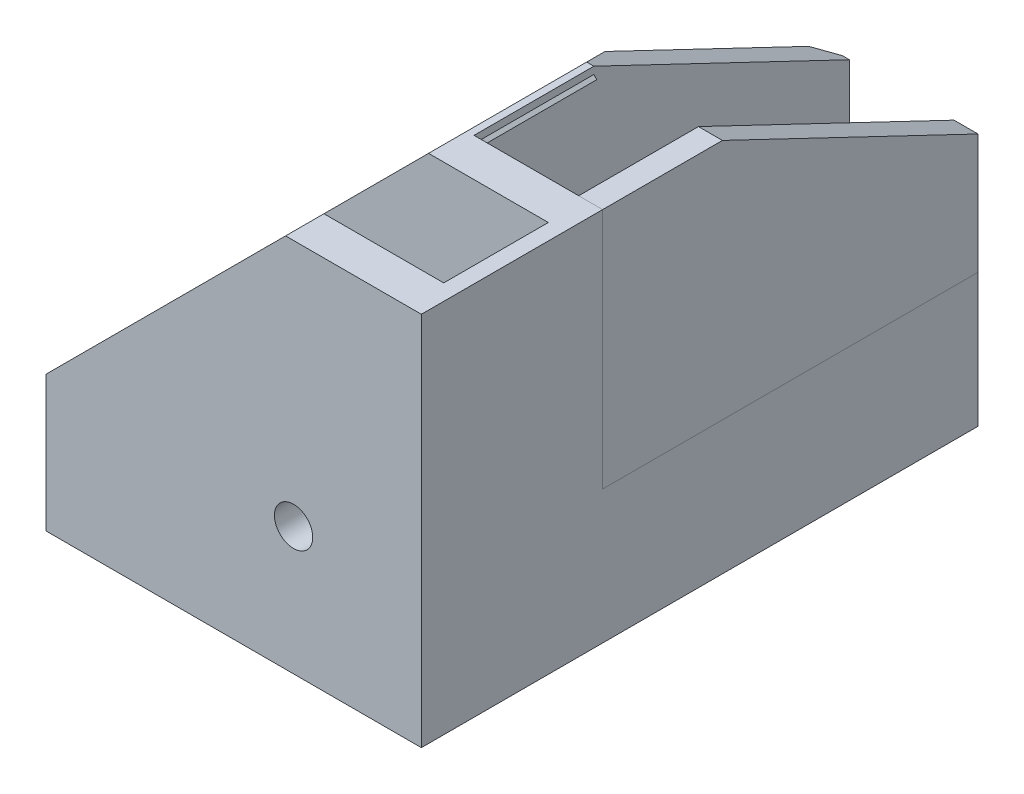
ISO-10303-21;
HEADER;
FILE_DESCRIPTION(('STEP AP214'),'2;1');
FILE_NAME('part.step','',(''),(''),'','','');
FILE_SCHEMA(('AUTOMOTIVE_DESIGN { 1 0 10303 214 1 1 1 1 }'));
ENDSEC;
DATA;
#1=APPLICATION_CONTEXT('core data for automotive mechanical design processes');
#2=APPLICATION_PROTOCOL_DEFINITION('international standard','automotive_design',2000,#1);
#3=PRODUCT_CONTEXT('',#1,'mechanical');
#4=PRODUCT('Part','Part','',(#3));
#5=PRODUCT_RELATED_PRODUCT_CATEGORY('part','',(#4));
#6=PRODUCT_DEFINITION_FORMATION('','',#4);
#7=PRODUCT_DEFINITION_CONTEXT('part definition',#1,'design');
#8=PRODUCT_DEFINITION('design','',#6,#7);
#9=PRODUCT_DEFINITION_SHAPE('','',#8);
#10=(LENGTH_UNIT() NAMED_UNIT(*) SI_UNIT(.MILLI.,.METRE.));
#11=(NAMED_UNIT(*) PLANE_ANGLE_UNIT() SI_UNIT($,.RADIAN.));
#12=(NAMED_UNIT(*) SI_UNIT($,.STERADIAN.) SOLID_ANGLE_UNIT());
#13=UNCERTAINTY_MEASURE_WITH_UNIT(LENGTH_MEASURE(1.E-05),#10,'distance_accuracy_value','');
#14=(GEOMETRIC_REPRESENTATION_CONTEXT(3) GLOBAL_UNCERTAINTY_ASSIGNED_CONTEXT((#13)) GLOBAL_UNIT_ASSIGNED_CONTEXT((#10,
#11,#12)) REPRESENTATION_CONTEXT('',''));
#15=CARTESIAN_POINT('',(0.,0.,0.));
#16=DIRECTION('',(0.,0.,1.));
#17=DIRECTION('',(1.,0.,0.));
#18=AXIS2_PLACEMENT_3D('',#15,#16,#17);
#19=CARTESIAN_POINT('',(-30.7272077938642,30.7272077938642,0.));
#20=DIRECTION('',(-0.707106781186548,0.707106781186547,0.));
#21=DIRECTION('',(-0.707106781186547,-0.707106781186548,0.));
#22=AXIS2_PLACEMENT_3D('',#19,#20,#21);
#23=PLANE('',#22);
#24=DIRECTION('',(0.,0.,-1.));
#25=VECTOR('',#24,1.);
#26=CARTESIAN_POINT('',(-15.7272077938642,45.7272077938642,-6.55));
#27=LINE('',#26,#25);
#28=CARTESIAN_POINT('',(-15.7272077938642,45.7272077938642,-11.35));
#29=VERTEX_POINT('',#28);
#30=CARTESIAN_POINT('',(-15.7272077938642,45.7272077938642,-26.35));
#31=VERTEX_POINT('',#30);
#32=EDGE_CURVE('E378',#29,#31,#27,.T.);
#33=ORIENTED_EDGE('',*,*,#32,.F.);
#34=DIRECTION('',(-0.707106781186547,-0.707106781186548,0.));
#35=VECTOR('',#34,1.);
#36=CARTESIAN_POINT('',(-30.7272077938642,30.7272077938642,-11.35));
#37=LINE('',#36,#35);
#38=CARTESIAN_POINT('',(-16.1,45.3544155877285,-11.35));
#39=VERTEX_POINT('',#38);
#40=EDGE_CURVE('E12',#29,#39,#37,.T.);
#41=ORIENTED_EDGE('',*,*,#40,.T.);
#42=DIRECTION('',(0.,0.,-1.));
#43=VECTOR('',#42,1.);
#44=CARTESIAN_POINT('',(-16.1,45.3544155877285,-58.35));
#45=LINE('',#44,#43);
#46=CARTESIAN_POINT('',(-16.1,45.3544155877285,-26.35));
#47=VERTEX_POINT('',#46);
#48=EDGE_CURVE('E405',#39,#47,#45,.T.);
#49=ORIENTED_EDGE('',*,*,#48,.T.);
#50=DIRECTION('',(-0.707106781186547,-0.707106781186548,0.));
#51=VECTOR('',#50,1.);
#52=CARTESIAN_POINT('',(-15.7272077938642,45.7272077938642,-26.35));
#53=LINE('',#52,#51);
#54=EDGE_CURVE('E382',#31,#47,#53,.T.);
#55=ORIENTED_EDGE('',*,*,#54,.F.);
#56=EDGE_LOOP('',(#33,#41,#49,#55));
#57=FACE_BOUND('',#56,.T.);
#58=ADVANCED_FACE('F43',(#57),#23,.F.);
#59=CARTESIAN_POINT('',(-15.7272077938642,45.7272077938642,-26.35));
#60=DIRECTION('',(0.,0.,-1.));
#61=DIRECTION('',(-1.,0.,0.));
#62=AXIS2_PLACEMENT_3D('',#59,#60,#61);
#63=PLANE('',#62);
#64=CARTESIAN_POINT('',(-19.1,42.3544155877285,-26.35));
#65=VERTEX_POINT('',#64);
#66=CARTESIAN_POINT('',(-44.7544155877284,16.7,-26.35));
#67=VERTEX_POINT('',#66);
#68=EDGE_CURVE('E380',#65,#67,#53,.T.);
#69=ORIENTED_EDGE('',*,*,#68,.T.);
#70=DIRECTION('',(-1.,0.,0.));
#71=VECTOR('',#70,1.);
#72=CARTESIAN_POINT('',(-15.7272077938642,16.7,-26.35));
#73=LINE('',#72,#71);
#74=CARTESIAN_POINT('',(-47.,16.7,-26.35));
#75=VERTEX_POINT('',#74);
#76=EDGE_CURVE('E370',#67,#75,#73,.T.);
#77=ORIENTED_EDGE('',*,*,#76,.T.);
#78=DIRECTION('',(-0.707106781186548,0.707106781186547,0.));
#79=VECTOR('',#78,1.);
#80=CARTESIAN_POINT('',(-45.8772077938642,15.5772077938642,-26.35));
#81=LINE('',#80,#79);
#82=CARTESIAN_POINT('',(-47.15,16.85,-26.35));
#83=VERTEX_POINT('',#82);
#84=EDGE_CURVE('E393',#75,#83,#81,.T.);
#85=ORIENTED_EDGE('',*,*,#84,.T.);
#86=DIRECTION('',(-0.707106781186547,-0.707106781186548,0.));
#87=VECTOR('',#86,1.);
#88=CARTESIAN_POINT('',(-17.,47.,-26.35));
#89=LINE('',#88,#87);
#90=CARTESIAN_POINT('',(-19.1,44.9,-26.35));
#91=VERTEX_POINT('',#90);
#92=EDGE_CURVE('E381',#91,#83,#89,.T.);
#93=ORIENTED_EDGE('',*,*,#92,.F.);
#94=DIRECTION('',(0.,1.,0.));
#95=VECTOR('',#94,1.);
#96=CARTESIAN_POINT('',(-19.1,16.7,-26.35));
#97=LINE('',#96,#95);
#98=EDGE_CURVE('E402',#65,#91,#97,.T.);
#99=ORIENTED_EDGE('',*,*,#98,.F.);
#100=EDGE_LOOP('',(#69,#77,#85,#93,#99));
#101=FACE_BOUND('',#100,.T.);
#102=ADVANCED_FACE('F480',(#101),#63,.T.);
#103=CARTESIAN_POINT('',(-45.8772077938642,15.5772077938642,-11.35));
#104=DIRECTION('',(-0.707106781186547,-0.707106781186548,0.));
#105=DIRECTION('',(0.707106781186548,-0.707106781186547,0.));
#106=AXIS2_PLACEMENT_3D('',#103,#104,#105);
#107=PLANE('',#106);
#108=DIRECTION('',(0.,0.,1.));
#109=VECTOR('',#108,1.);
#110=CARTESIAN_POINT('',(-47.,16.7,-11.35));
#111=LINE('',#110,#109);
#112=CARTESIAN_POINT('',(-47.,16.7,-6.55));
#113=VERTEX_POINT('',#112);
#114=EDGE_CURVE('E451',#75,#113,#111,.T.);
#115=ORIENTED_EDGE('',*,*,#114,.T.);
#116=DIRECTION('',(-0.707106781186548,0.707106781186547,0.));
#117=VECTOR('',#116,1.);
#118=CARTESIAN_POINT('',(-45.8772077938642,15.5772077938642,-6.55));
#119=LINE('',#118,#117);
#120=CARTESIAN_POINT('',(-47.15,16.85,-6.55));
#121=VERTEX_POINT('',#120);
#122=EDGE_CURVE('E385',#113,#121,#119,.T.);
#123=ORIENTED_EDGE('',*,*,#122,.T.);
#124=DIRECTION('',(0.,0.,1.));
#125=VECTOR('',#124,1.);
#126=CARTESIAN_POINT('',(-47.15,16.85,-11.35));
#127=LINE('',#126,#125);
#128=EDGE_CURVE('E377',#83,#121,#127,.T.);
#129=ORIENTED_EDGE('',*,*,#128,.F.);
#130=ORIENTED_EDGE('',*,*,#84,.F.);
#131=EDGE_LOOP('',(#115,#123,#129,#130));
#132=FACE_BOUND('',#131,.T.);
#133=ADVANCED_FACE('F482',(#132),#107,.T.);
#134=CARTESIAN_POINT('',(-19.1,16.7,-58.35));
#135=DIRECTION('',(1.,0.,0.));
#136=DIRECTION('',(0.,1.,0.));
#137=AXIS2_PLACEMENT_3D('',#134,#135,#136);
#138=PLANE('',#137);
#139=DIRECTION('',(0.,0.,1.));
#140=VECTOR('',#139,1.);
#141=CARTESIAN_POINT('',(-19.1,42.3544155877285,-58.35));
#142=LINE('',#141,#140);
#143=CARTESIAN_POINT('',(-19.1,42.3544155877285,-11.35));
#144=VERTEX_POINT('',#143);
#145=EDGE_CURVE('E407',#65,#144,#142,.T.);
#146=ORIENTED_EDGE('',*,*,#145,.F.);
#147=ORIENTED_EDGE('',*,*,#98,.T.);
#148=DIRECTION('',(0.,0.,1.));
#149=VECTOR('',#148,1.);
#150=CARTESIAN_POINT('',(-19.1,44.9,-58.35));
#151=LINE('',#150,#149);
#152=CARTESIAN_POINT('',(-19.1,44.9,-30.7421568627451));
#153=VERTEX_POINT('',#152);
#154=EDGE_CURVE('E445',#153,#91,#151,.T.);
#155=ORIENTED_EDGE('',*,*,#154,.F.);
#156=DIRECTION('',(0.,-0.431355734164351,-0.902181927664002));
#157=VECTOR('',#156,1.);
#158=CARTESIAN_POINT('',(-19.1,28.908983459053,-64.1874202163597));
#159=LINE('',#158,#157);
#160=CARTESIAN_POINT('',(-19.1,32.7040625,-56.25));
#161=VERTEX_POINT('',#160);
#162=EDGE_CURVE('E64',#153,#161,#159,.T.);
#163=ORIENTED_EDGE('',*,*,#162,.T.);
#164=DIRECTION('',(0.,-1.,0.));
#165=VECTOR('',#164,1.);
#166=CARTESIAN_POINT('',(-19.1,63.7,-56.25));
#167=LINE('',#166,#165);
#168=CARTESIAN_POINT('',(-19.1,16.7,-56.25));
#169=VERTEX_POINT('',#168);
#170=EDGE_CURVE('E422',#161,#169,#167,.T.);
#171=ORIENTED_EDGE('',*,*,#170,.T.);
#172=DIRECTION('',(0.,0.,1.));
#173=VECTOR('',#172,1.);
#174=CARTESIAN_POINT('',(-19.1,16.7,-58.35));
#175=LINE('',#174,#173);
#176=CARTESIAN_POINT('',(-19.1,16.7,-11.35));
#177=VERTEX_POINT('',#176);
#178=EDGE_CURVE('E429',#169,#177,#175,.T.);
#179=ORIENTED_EDGE('',*,*,#178,.T.);
#180=DIRECTION('',(0.,1.,0.));
#181=VECTOR('',#180,1.);
#182=CARTESIAN_POINT('',(-19.1,16.7,-11.35));
#183=LINE('',#182,#181);
#184=EDGE_CURVE('E425',#177,#144,#183,.T.);
#185=ORIENTED_EDGE('',*,*,#184,.T.);
#186=EDGE_LOOP('',(#146,#147,#155,#163,#171,#179,#185));
#187=FACE_BOUND('',#186,.T.);
#188=ADVANCED_FACE('F45',(#187),#138,.F.);
#189=CARTESIAN_POINT('',(-19.1,44.9,-58.35));
#190=DIRECTION('',(0.707106781186546,-0.707106781186549,0.));
#191=DIRECTION('',(0.707106781186549,0.707106781186546,0.));
#192=AXIS2_PLACEMENT_3D('',#189,#190,#191);
#193=PLANE('',#192);
#194=DIRECTION('',(0.707106781186547,0.707106781186548,0.));
#195=VECTOR('',#194,1.);
#196=CARTESIAN_POINT('',(-47.15,16.85,-6.55));
#197=LINE('',#196,#195);
#198=CARTESIAN_POINT('',(-17.,47.,-6.55));
#199=VERTEX_POINT('',#198);
#200=EDGE_CURVE('E388',#121,#199,#197,.T.);
#201=ORIENTED_EDGE('',*,*,#200,.T.);
#202=DIRECTION('',(0.,0.,1.));
#203=VECTOR('',#202,1.);
#204=CARTESIAN_POINT('',(-17.,47.,-58.35));
#205=LINE('',#204,#203);
#206=CARTESIAN_POINT('',(-17.,47.,-26.35));
#207=VERTEX_POINT('',#206);
#208=EDGE_CURVE('E443',#207,#199,#205,.T.);
#209=ORIENTED_EDGE('',*,*,#208,.F.);
#210=DIRECTION('',(-0.396078094015386,-0.396078094015385,-0.828398628006034));
#211=VECTOR('',#210,1.);
#212=CARTESIAN_POINT('',(-28.1584245868461,35.8415754131539,-49.6878814888284));
#213=LINE('',#212,#211);
#214=EDGE_CURVE('E417',#207,#153,#213,.T.);
#215=ORIENTED_EDGE('',*,*,#214,.T.);
#216=ORIENTED_EDGE('',*,*,#154,.T.);
#217=ORIENTED_EDGE('',*,*,#92,.T.);
#218=ORIENTED_EDGE('',*,*,#128,.T.);
#219=EDGE_LOOP('',(#201,#209,#215,#216,#217,#218));
#220=FACE_BOUND('',#219,.T.);
#221=ADVANCED_FACE('F486',(#220),#193,.F.);
#222=CARTESIAN_POINT('',(-17.,47.,-58.35));
#223=DIRECTION('',(0.,-1.,0.));
#224=DIRECTION('',(0.,0.,-1.));
#225=AXIS2_PLACEMENT_3D('',#222,#223,#224);
#226=PLANE('',#225);
#227=DIRECTION('',(0.,0.,1.));
#228=VECTOR('',#227,1.);
#229=CARTESIAN_POINT('',(-16.1,47.,-58.35));
#230=LINE('',#229,#228);
#231=CARTESIAN_POINT('',(-16.1,47.,-26.35));
#232=VERTEX_POINT('',#231);
#233=CARTESIAN_POINT('',(-16.1,47.,-11.35));
#234=VERTEX_POINT('',#233);
#235=EDGE_CURVE('E440',#232,#234,#230,.T.);
#236=ORIENTED_EDGE('',*,*,#235,.F.);
#237=DIRECTION('',(1.,0.,0.));
#238=VECTOR('',#237,1.);
#239=CARTESIAN_POINT('',(-47.,47.,-26.35));
#240=LINE('',#239,#238);
#241=EDGE_CURVE('E413',#207,#232,#240,.T.);
#242=ORIENTED_EDGE('',*,*,#241,.F.);
#243=ORIENTED_EDGE('',*,*,#208,.T.);
#244=DIRECTION('',(-1.,0.,0.));
#245=VECTOR('',#244,1.);
#246=CARTESIAN_POINT('',(-17.,47.,-6.55));
#247=LINE('',#246,#245);
#248=CARTESIAN_POINT('',(-2.,47.,-6.55));
#249=VERTEX_POINT('',#248);
#250=EDGE_CURVE('E329',#249,#199,#247,.T.);
#251=ORIENTED_EDGE('',*,*,#250,.F.);
#252=DIRECTION('',(0.,0.,1.));
#253=VECTOR('',#252,1.);
#254=CARTESIAN_POINT('',(-2.,47.,-6.55));
#255=LINE('',#254,#253);
#256=CARTESIAN_POINT('',(-2.,47.,6.55));
#257=VERTEX_POINT('',#256);
#258=EDGE_CURVE('E332',#249,#257,#255,.T.);
#259=ORIENTED_EDGE('',*,*,#258,.T.);
#260=DIRECTION('',(-1.,0.,0.));
#261=VECTOR('',#260,1.);
#262=CARTESIAN_POINT('',(-17.,47.,6.55));
#263=LINE('',#262,#261);
#264=CARTESIAN_POINT('',(-17.,47.,6.55));
#265=VERTEX_POINT('',#264);
#266=EDGE_CURVE('E237',#257,#265,#263,.T.);
#267=ORIENTED_EDGE('',*,*,#266,.T.);
#268=DIRECTION('',(0.,0.,-1.));
#269=VECTOR('',#268,1.);
#270=CARTESIAN_POINT('',(-17.,47.,11.35));
#271=LINE('',#270,#269);
#272=CARTESIAN_POINT('',(-17.,47.,11.35));
#273=VERTEX_POINT('',#272);
#274=EDGE_CURVE('E362',#273,#265,#271,.T.);
#275=ORIENTED_EDGE('',*,*,#274,.F.);
#276=DIRECTION('',(-1.,0.,0.));
#277=VECTOR('',#276,1.);
#278=CARTESIAN_POINT('',(0.,47.,11.35));
#279=LINE('',#278,#277);
#280=CARTESIAN_POINT('',(0.,47.,11.35));
#281=VERTEX_POINT('',#280);
#282=EDGE_CURVE('E345',#281,#273,#279,.T.);
#283=ORIENTED_EDGE('',*,*,#282,.F.);
#284=DIRECTION('',(0.,0.,-1.));
#285=VECTOR('',#284,1.);
#286=CARTESIAN_POINT('',(0.,47.,11.35));
#287=LINE('',#286,#285);
#288=CARTESIAN_POINT('',(0.,47.,-11.35));
#289=VERTEX_POINT('',#288);
#290=EDGE_CURVE('E365',#281,#289,#287,.T.);
#291=ORIENTED_EDGE('',*,*,#290,.T.);
#292=DIRECTION('',(-1.,0.,0.));
#293=VECTOR('',#292,1.);
#294=CARTESIAN_POINT('',(0.,47.,-11.35));
#295=LINE('',#294,#293);
#296=EDGE_CURVE('E353',#289,#234,#295,.T.);
#297=ORIENTED_EDGE('',*,*,#296,.T.);
#298=EDGE_LOOP('',(#236,#242,#243,#251,#259,#267,#275,#283,#291,#297));
#299=FACE_BOUND('',#298,.T.);
#300=ADVANCED_FACE('F492',(#299),#226,.F.);
#301=CARTESIAN_POINT('',(-16.1,47.,-58.35));
#302=DIRECTION('',(-1.,0.,0.));
#303=DIRECTION('',(0.,-1.,0.));
#304=AXIS2_PLACEMENT_3D('',#301,#302,#303);
#305=PLANE('',#304);
#306=DIRECTION('',(0.,-1.,0.));
#307=VECTOR('',#306,1.);
#308=CARTESIAN_POINT('',(-16.1,47.,-11.35));
#309=LINE('',#308,#307);
#310=CARTESIAN_POINT('',(-16.1,46.1,-11.35));
#311=VERTEX_POINT('',#310);
#312=EDGE_CURVE('E430',#234,#311,#309,.T.);
#313=ORIENTED_EDGE('',*,*,#312,.T.);
#314=DIRECTION('',(0.,0.,-1.));
#315=VECTOR('',#314,1.);
#316=CARTESIAN_POINT('',(-16.1,46.1,-58.35));
#317=LINE('',#316,#315);
#318=CARTESIAN_POINT('',(-16.1,46.1,-26.35));
#319=VERTEX_POINT('',#318);
#320=EDGE_CURVE('E410',#311,#319,#317,.T.);
#321=ORIENTED_EDGE('',*,*,#320,.T.);
#322=DIRECTION('',(0.,-1.,0.));
#323=VECTOR('',#322,1.);
#324=CARTESIAN_POINT('',(-16.1,47.,-26.35));
#325=LINE('',#324,#323);
#326=EDGE_CURVE('E395',#319,#47,#325,.T.);
#327=ORIENTED_EDGE('',*,*,#326,.T.);
#328=ORIENTED_EDGE('',*,*,#48,.F.);
#329=CARTESIAN_POINT('',(-16.1,16.7,-11.35));
#330=VERTEX_POINT('',#329);
#331=EDGE_CURVE('E433',#39,#330,#309,.T.);
#332=ORIENTED_EDGE('',*,*,#331,.T.);
#333=DIRECTION('',(0.,0.,1.));
#334=VECTOR('',#333,1.);
#335=CARTESIAN_POINT('',(-16.1,16.7,-58.35));
#336=LINE('',#335,#334);
#337=CARTESIAN_POINT('',(-16.1,16.7,-58.35));
#338=VERTEX_POINT('',#337);
#339=EDGE_CURVE('E438',#338,#330,#336,.T.);
#340=ORIENTED_EDGE('',*,*,#339,.F.);
#341=DIRECTION('',(0.,-1.,0.));
#342=VECTOR('',#341,1.);
#343=CARTESIAN_POINT('',(-16.1,47.,-58.35));
#344=LINE('',#343,#342);
#345=CARTESIAN_POINT('',(-16.1,31.7,-58.35));
#346=VERTEX_POINT('',#345);
#347=EDGE_CURVE('E426',#346,#338,#344,.T.);
#348=ORIENTED_EDGE('',*,*,#347,.F.);
#349=DIRECTION('',(0.,0.431355734164351,0.902181927664002));
#350=VECTOR('',#349,1.);
#351=CARTESIAN_POINT('',(-16.1,34.5468368717659,-52.3958313793131));
#352=LINE('',#351,#350);
#353=EDGE_CURVE('E419',#346,#232,#352,.T.);
#354=ORIENTED_EDGE('',*,*,#353,.T.);
#355=ORIENTED_EDGE('',*,*,#235,.T.);
#356=EDGE_LOOP('',(#313,#321,#327,#328,#332,#340,#348,#354,#355));
#357=FACE_BOUND('',#356,.T.);
#358=ADVANCED_FACE('F496',(#357),#305,.F.);
#359=CARTESIAN_POINT('',(0.,0.,-58.35));
#360=DIRECTION('',(0.,0.,-1.));
#361=DIRECTION('',(-1.,0.,0.));
#362=AXIS2_PLACEMENT_3D('',#359,#360,#361);
#363=PLANE('',#362);
#364=DIRECTION('',(1.,0.,0.));
#365=VECTOR('',#364,1.);
#366=CARTESIAN_POINT('',(-47.,31.7,-58.35));
#367=LINE('',#366,#365);
#368=CARTESIAN_POINT('',(-17.,31.7,-58.35));
#369=VERTEX_POINT('',#368);
#370=EDGE_CURVE('E58',#369,#346,#367,.T.);
#371=ORIENTED_EDGE('',*,*,#370,.T.);
#372=ORIENTED_EDGE('',*,*,#347,.T.);
#373=DIRECTION('',(1.,0.,0.));
#374=VECTOR('',#373,1.);
#375=CARTESIAN_POINT('',(-47.,16.7,-58.35));
#376=LINE('',#375,#374);
#377=CARTESIAN_POINT('',(0.,16.7,-58.35));
#378=VERTEX_POINT('',#377);
#379=EDGE_CURVE('E294',#338,#378,#376,.T.);
#380=ORIENTED_EDGE('',*,*,#379,.T.);
#381=DIRECTION('',(0.,-1.,0.));
#382=VECTOR('',#381,1.);
#383=CARTESIAN_POINT('',(0.,14.7,-58.35));
#384=LINE('',#383,#382);
#385=CARTESIAN_POINT('',(0.,0.,-58.35));
#386=VERTEX_POINT('',#385);
#387=EDGE_CURVE('E296',#378,#386,#384,.T.);
#388=ORIENTED_EDGE('',*,*,#387,.T.);
#389=DIRECTION('',(-1.,0.,0.));
#390=VECTOR('',#389,1.);
#391=CARTESIAN_POINT('',(-47.,0.,-58.35));
#392=LINE('',#391,#390);
#393=CARTESIAN_POINT('',(-17.,0.,-58.35));
#394=VERTEX_POINT('',#393);
#395=EDGE_CURVE('E283',#386,#394,#392,.T.);
#396=ORIENTED_EDGE('',*,*,#395,.T.);
#397=DIRECTION('',(0.,1.,0.));
#398=VECTOR('',#397,1.);
#399=CARTESIAN_POINT('',(-17.,0.,-58.35));
#400=LINE('',#399,#398);
#401=CARTESIAN_POINT('',(-17.,1.8,-58.35));
#402=VERTEX_POINT('',#401);
#403=EDGE_CURVE('E269',#394,#402,#400,.T.);
#404=ORIENTED_EDGE('',*,*,#403,.T.);
#405=DIRECTION('',(1.,0.,0.));
#406=VECTOR('',#405,1.);
#407=CARTESIAN_POINT('',(-2.,1.8,-58.35));
#408=LINE('',#407,#406);
#409=CARTESIAN_POINT('',(-2.,1.8,-58.35));
#410=VERTEX_POINT('',#409);
#411=EDGE_CURVE('E286',#402,#410,#408,.T.);
#412=ORIENTED_EDGE('',*,*,#411,.T.);
#413=DIRECTION('',(0.,1.,0.));
#414=VECTOR('',#413,1.);
#415=CARTESIAN_POINT('',(-2.,1.8,-58.35));
#416=LINE('',#415,#414);
#417=CARTESIAN_POINT('',(-2.,14.9,-58.35));
#418=VERTEX_POINT('',#417);
#419=EDGE_CURVE('E289',#410,#418,#416,.T.);
#420=ORIENTED_EDGE('',*,*,#419,.T.);
#421=DIRECTION('',(-1.,0.,0.));
#422=VECTOR('',#421,1.);
#423=CARTESIAN_POINT('',(-2.,14.9,-58.35));
#424=LINE('',#423,#422);
#425=CARTESIAN_POINT('',(-17.,14.9,-58.35));
#426=VERTEX_POINT('',#425);
#427=EDGE_CURVE('E291',#418,#426,#424,.T.);
#428=ORIENTED_EDGE('',*,*,#427,.T.);
#429=DIRECTION('',(0.,-1.,0.));
#430=VECTOR('',#429,1.);
#431=CARTESIAN_POINT('',(-17.,0.,-58.35));
#432=LINE('',#431,#430);
#433=EDGE_CURVE('E448',#369,#426,#432,.T.);
#434=ORIENTED_EDGE('',*,*,#433,.F.);
#435=EDGE_LOOP('',(#371,#372,#380,#388,#396,#404,#412,#420,#428,#434));
#436=FACE_BOUND('',#435,.T.);
#437=ADVANCED_FACE('F500',(#436),#363,.T.);
#438=CARTESIAN_POINT('',(-19.1,63.7,-56.25));
#439=DIRECTION('',(0.707106781186554,0.,0.707106781186541));
#440=DIRECTION('',(0.707106781186541,0.,-0.707106781186554));
#441=AXIS2_PLACEMENT_3D('',#438,#439,#440);
#442=PLANE('',#441);
#443=ORIENTED_EDGE('',*,*,#170,.F.);
#444=DIRECTION('',(0.669859304744955,-0.320276480081187,-0.669859304744967));
#445=VECTOR('',#444,1.);
#446=CARTESIAN_POINT('',(-25.7498740189914,35.8835335153303,-49.6001259810085));
#447=LINE('',#446,#445);
#448=EDGE_CURVE('E450',#161,#369,#447,.T.);
#449=ORIENTED_EDGE('',*,*,#448,.T.);
#450=ORIENTED_EDGE('',*,*,#433,.T.);
#451=DIRECTION('',(0.707106781186548,0.,-0.707106781186548));
#452=VECTOR('',#451,1.);
#453=CARTESIAN_POINT('',(-9.5,14.9,-65.85));
#454=LINE('',#453,#452);
#455=CARTESIAN_POINT('',(-47.,14.9,-28.35));
#456=VERTEX_POINT('',#455);
#457=EDGE_CURVE('E276',#456,#426,#454,.T.);
#458=ORIENTED_EDGE('',*,*,#457,.F.);
#459=DIRECTION('',(0.,1.,0.));
#460=VECTOR('',#459,1.);
#461=CARTESIAN_POINT('',(-47.,0.,-28.35));
#462=LINE('',#461,#460);
#463=CARTESIAN_POINT('',(-47.,16.7,-28.35));
#464=VERTEX_POINT('',#463);
#465=EDGE_CURVE('E268',#456,#464,#462,.T.);
#466=ORIENTED_EDGE('',*,*,#465,.T.);
#467=DIRECTION('',(-0.707106781186548,0.,0.707106781186548));
#468=VECTOR('',#467,1.);
#469=CARTESIAN_POINT('',(-32.,16.7,-43.35));
#470=LINE('',#469,#468);
#471=EDGE_CURVE('E272',#169,#464,#470,.T.);
#472=ORIENTED_EDGE('',*,*,#471,.F.);
#473=EDGE_LOOP('',(#443,#449,#450,#458,#466,#472));
#474=FACE_BOUND('',#473,.T.);
#475=ADVANCED_FACE('F473',(#474),#442,.F.);
#476=CARTESIAN_POINT('',(-47.,31.7,-58.35));
#477=DIRECTION('',(0.,-0.902181927664002,0.431355734164351));
#478=DIRECTION('',(0.,-0.431355734164351,-0.902181927664002));
#479=AXIS2_PLACEMENT_3D('',#476,#477,#478);
#480=PLANE('',#479);
#481=ORIENTED_EDGE('',*,*,#370,.F.);
#482=ORIENTED_EDGE('',*,*,#448,.F.);
#483=ORIENTED_EDGE('',*,*,#162,.F.);
#484=ORIENTED_EDGE('',*,*,#214,.F.);
#485=ORIENTED_EDGE('',*,*,#241,.T.);
#486=ORIENTED_EDGE('',*,*,#353,.F.);
#487=EDGE_LOOP('',(#481,#482,#483,#484,#485,#486));
#488=FACE_BOUND('',#487,.T.);
#489=ADVANCED_FACE('F489',(#488),#480,.F.);
#490=CARTESIAN_POINT('',(-15.7272077938642,45.7272077938642,-6.55));
#491=DIRECTION('',(0.707106781186547,0.707106781186548,0.));
#492=DIRECTION('',(-0.707106781186548,0.707106781186547,0.));
#493=AXIS2_PLACEMENT_3D('',#490,#491,#492);
#494=PLANE('',#493);
#495=DIRECTION('',(-0.707106781186548,0.707106781186547,0.));
#496=VECTOR('',#495,1.);
#497=CARTESIAN_POINT('',(-15.7272077938642,45.7272077938642,-11.35));
#498=LINE('',#497,#496);
#499=EDGE_CURVE('E375',#29,#311,#498,.T.);
#500=ORIENTED_EDGE('',*,*,#499,.F.);
#501=ORIENTED_EDGE('',*,*,#32,.T.);
#502=DIRECTION('',(-0.707106781186548,0.707106781186547,0.));
#503=VECTOR('',#502,1.);
#504=CARTESIAN_POINT('',(-15.7272077938642,45.7272077938642,-26.35));
#505=LINE('',#504,#503);
#506=EDGE_CURVE('E396',#31,#319,#505,.T.);
#507=ORIENTED_EDGE('',*,*,#506,.T.);
#508=ORIENTED_EDGE('',*,*,#320,.F.);
#509=EDGE_LOOP('',(#500,#501,#507,#508));
#510=FACE_BOUND('',#509,.T.);
#511=ADVANCED_FACE('F566',(#510),#494,.T.);
#512=ORIENTED_EDGE('',*,*,#145,.T.);
#513=CARTESIAN_POINT('',(-44.7544155877285,16.7,-11.35));
#514=VERTEX_POINT('',#513);
#515=EDGE_CURVE('E47',#144,#514,#37,.T.);
#516=ORIENTED_EDGE('',*,*,#515,.T.);
#517=DIRECTION('',(0.,0.,1.));
#518=VECTOR('',#517,1.);
#519=CARTESIAN_POINT('',(-44.7544155877285,16.7,0.));
#520=LINE('',#519,#518);
#521=EDGE_CURVE('E373',#67,#514,#520,.T.);
#522=ORIENTED_EDGE('',*,*,#521,.F.);
#523=ORIENTED_EDGE('',*,*,#68,.F.);
#524=EDGE_LOOP('',(#512,#516,#522,#523));
#525=FACE_BOUND('',#524,.T.);
#526=ADVANCED_FACE('F458',(#525),#23,.F.);
#527=ORIENTED_EDGE('',*,*,#326,.F.);
#528=ORIENTED_EDGE('',*,*,#506,.F.);
#529=ORIENTED_EDGE('',*,*,#54,.T.);
#530=EDGE_LOOP('',(#527,#528,#529));
#531=FACE_BOUND('',#530,.T.);
#532=ADVANCED_FACE('F545',(#531),#63,.T.);
#533=CARTESIAN_POINT('',(-45.8772077938642,15.5772077938642,-6.55));
#534=DIRECTION('',(0.,0.,1.));
#535=DIRECTION('',(1.,0.,0.));
#536=AXIS2_PLACEMENT_3D('',#533,#534,#535);
#537=PLANE('',#536);
#538=ORIENTED_EDGE('',*,*,#250,.T.);
#539=ORIENTED_EDGE('',*,*,#200,.F.);
#540=ORIENTED_EDGE('',*,*,#122,.F.);
#541=DIRECTION('',(0.,-1.,0.));
#542=VECTOR('',#541,1.);
#543=CARTESIAN_POINT('',(-47.,17.,-6.55));
#544=LINE('',#543,#542);
#545=CARTESIAN_POINT('',(-47.,0.,-6.55));
#546=VERTEX_POINT('',#545);
#547=EDGE_CURVE('E326',#113,#546,#544,.T.);
#548=ORIENTED_EDGE('',*,*,#547,.T.);
#549=DIRECTION('',(1.,0.,0.));
#550=VECTOR('',#549,1.);
#551=CARTESIAN_POINT('',(-2.,0.,-6.55));
#552=LINE('',#551,#550);
#553=CARTESIAN_POINT('',(-2.,0.,-6.55));
#554=VERTEX_POINT('',#553);
#555=EDGE_CURVE('E256',#546,#554,#552,.T.);
#556=ORIENTED_EDGE('',*,*,#555,.T.);
#557=DIRECTION('',(0.,1.,0.));
#558=VECTOR('',#557,1.);
#559=CARTESIAN_POINT('',(-2.,47.,-6.55));
#560=LINE('',#559,#558);
#561=EDGE_CURVE('E246',#554,#249,#560,.T.);
#562=ORIENTED_EDGE('',*,*,#561,.T.);
#563=EDGE_LOOP('',(#538,#539,#540,#548,#556,#562));
#564=FACE_BOUND('',#563,.T.);
#565=ADVANCED_FACE('F543',(#564),#537,.T.);
#566=CARTESIAN_POINT('',(0.,0.,-11.35));
#567=DIRECTION('',(0.,0.,-1.));
#568=DIRECTION('',(-1.,0.,0.));
#569=AXIS2_PLACEMENT_3D('',#566,#567,#568);
#570=PLANE('',#569);
#571=ORIENTED_EDGE('',*,*,#184,.F.);
#572=DIRECTION('',(1.,0.,0.));
#573=VECTOR('',#572,1.);
#574=CARTESIAN_POINT('',(-47.,16.7,-11.35));
#575=LINE('',#574,#573);
#576=EDGE_CURVE('E287',#514,#177,#575,.T.);
#577=ORIENTED_EDGE('',*,*,#576,.F.);
#578=ORIENTED_EDGE('',*,*,#515,.F.);
#579=EDGE_LOOP('',(#571,#577,#578));
#580=FACE_BOUND('',#579,.T.);
#581=ADVANCED_FACE('F464',(#580),#570,.T.);
#582=ORIENTED_EDGE('',*,*,#331,.F.);
#583=ORIENTED_EDGE('',*,*,#40,.F.);
#584=ORIENTED_EDGE('',*,*,#499,.T.);
#585=ORIENTED_EDGE('',*,*,#312,.F.);
#586=ORIENTED_EDGE('',*,*,#296,.F.);
#587=DIRECTION('',(0.,1.,0.));
#588=VECTOR('',#587,1.);
#589=CARTESIAN_POINT('',(0.,0.,-11.35));
#590=LINE('',#589,#588);
#591=CARTESIAN_POINT('',(0.,16.7,-11.35));
#592=VERTEX_POINT('',#591);
#593=EDGE_CURVE('E338',#592,#289,#590,.T.);
#594=ORIENTED_EDGE('',*,*,#593,.F.);
#595=EDGE_CURVE('E308',#330,#592,#575,.T.);
#596=ORIENTED_EDGE('',*,*,#595,.F.);
#597=EDGE_LOOP('',(#582,#583,#584,#585,#586,#594,#596));
#598=FACE_BOUND('',#597,.T.);
#599=ADVANCED_FACE('F551',(#598),#570,.T.);
#600=CARTESIAN_POINT('',(-47.,16.7,-58.35));
#601=DIRECTION('',(0.,-1.,0.));
#602=DIRECTION('',(0.,0.,-1.));
#603=AXIS2_PLACEMENT_3D('',#600,#601,#602);
#604=PLANE('',#603);
#605=ORIENTED_EDGE('',*,*,#576,.T.);
#606=ORIENTED_EDGE('',*,*,#178,.F.);
#607=ORIENTED_EDGE('',*,*,#471,.T.);
#608=DIRECTION('',(0.,0.,1.));
#609=VECTOR('',#608,1.);
#610=CARTESIAN_POINT('',(-47.,16.7,-58.35));
#611=LINE('',#610,#609);
#612=EDGE_CURVE('E312',#464,#75,#611,.T.);
#613=ORIENTED_EDGE('',*,*,#612,.T.);
#614=ORIENTED_EDGE('',*,*,#76,.F.);
#615=ORIENTED_EDGE('',*,*,#521,.T.);
#616=EDGE_LOOP('',(#605,#606,#607,#613,#614,#615));
#617=FACE_BOUND('',#616,.T.);
#618=ADVANCED_FACE('F467',(#617),#604,.F.);
#619=ORIENTED_EDGE('',*,*,#379,.F.);
#620=ORIENTED_EDGE('',*,*,#339,.T.);
#621=ORIENTED_EDGE('',*,*,#595,.T.);
#622=DIRECTION('',(0.,0.,1.));
#623=VECTOR('',#622,1.);
#624=CARTESIAN_POINT('',(0.,16.7,-58.35));
#625=LINE('',#624,#623);
#626=EDGE_CURVE('E299',#378,#592,#625,.T.);
#627=ORIENTED_EDGE('',*,*,#626,.F.);
#628=EDGE_LOOP('',(#619,#620,#621,#627));
#629=FACE_BOUND('',#628,.T.);
#630=ADVANCED_FACE('F585',(#629),#604,.F.);
#631=CARTESIAN_POINT('',(-47.,0.,11.35));
#632=DIRECTION('',(1.,0.,0.));
#633=DIRECTION('',(0.,0.,-1.));
#634=AXIS2_PLACEMENT_3D('',#631,#632,#633);
#635=PLANE('',#634);
#636=DIRECTION('',(0.,-1.,0.));
#637=VECTOR('',#636,1.);
#638=CARTESIAN_POINT('',(-47.,17.,6.55));
#639=LINE('',#638,#637);
#640=CARTESIAN_POINT('',(-47.,17.,6.55));
#641=VERTEX_POINT('',#640);
#642=CARTESIAN_POINT('',(-47.,0.,6.55));
#643=VERTEX_POINT('',#642);
#644=EDGE_CURVE('E240',#641,#643,#639,.T.);
#645=ORIENTED_EDGE('',*,*,#644,.T.);
#646=DIRECTION('',(0.,0.,-1.));
#647=VECTOR('',#646,1.);
#648=CARTESIAN_POINT('',(-47.,0.,11.35));
#649=LINE('',#648,#647);
#650=CARTESIAN_POINT('',(-47.,0.,11.35));
#651=VERTEX_POINT('',#650);
#652=EDGE_CURVE('E255',#651,#643,#649,.T.);
#653=ORIENTED_EDGE('',*,*,#652,.F.);
#654=DIRECTION('',(0.,-1.,0.));
#655=VECTOR('',#654,1.);
#656=CARTESIAN_POINT('',(-47.,0.,11.35));
#657=LINE('',#656,#655);
#658=CARTESIAN_POINT('',(-47.,17.,11.35));
#659=VERTEX_POINT('',#658);
#660=EDGE_CURVE('E349',#659,#651,#657,.T.);
#661=ORIENTED_EDGE('',*,*,#660,.F.);
#662=DIRECTION('',(0.,0.,-1.));
#663=VECTOR('',#662,1.);
#664=CARTESIAN_POINT('',(-47.,17.,11.35));
#665=LINE('',#664,#663);
#666=EDGE_CURVE('E359',#659,#641,#665,.T.);
#667=ORIENTED_EDGE('',*,*,#666,.T.);
#668=EDGE_LOOP('',(#645,#653,#661,#667));
#669=FACE_BOUND('',#668,.T.);
#670=ADVANCED_FACE('F537',(#669),#635,.F.);
#671=CARTESIAN_POINT('',(-17.,47.,11.35));
#672=DIRECTION('',(0.707106781186548,-0.707106781186548,0.));
#673=DIRECTION('',(0.707106781186548,0.707106781186548,0.));
#674=AXIS2_PLACEMENT_3D('',#671,#672,#673);
#675=PLANE('',#674);
#676=DIRECTION('',(-0.707106781186547,-0.707106781186547,0.));
#677=VECTOR('',#676,1.);
#678=CARTESIAN_POINT('',(-47.,17.,6.55));
#679=LINE('',#678,#677);
#680=EDGE_CURVE('E325',#265,#641,#679,.T.);
#681=ORIENTED_EDGE('',*,*,#680,.T.);
#682=ORIENTED_EDGE('',*,*,#666,.F.);
#683=DIRECTION('',(-0.707106781186547,-0.707106781186547,0.));
#684=VECTOR('',#683,1.);
#685=CARTESIAN_POINT('',(-17.,47.,11.35));
#686=LINE('',#685,#684);
#687=EDGE_CURVE('E347',#273,#659,#686,.T.);
#688=ORIENTED_EDGE('',*,*,#687,.F.);
#689=ORIENTED_EDGE('',*,*,#274,.T.);
#690=EDGE_LOOP('',(#681,#682,#688,#689));
#691=FACE_BOUND('',#690,.T.);
#692=ADVANCED_FACE('F539',(#691),#675,.F.);
#693=CARTESIAN_POINT('',(0.,0.,11.35));
#694=DIRECTION('',(0.,1.,0.));
#695=DIRECTION('',(-1.,0.,0.));
#696=AXIS2_PLACEMENT_3D('',#693,#694,#695);
#697=PLANE('',#696);
#698=ORIENTED_EDGE('',*,*,#652,.T.);
#699=DIRECTION('',(-1.,0.,0.));
#700=VECTOR('',#699,1.);
#701=CARTESIAN_POINT('',(-47.,0.,6.55));
#702=LINE('',#701,#700);
#703=CARTESIAN_POINT('',(-2.,0.,6.55));
#704=VERTEX_POINT('',#703);
#705=EDGE_CURVE('E234',#704,#643,#702,.T.);
#706=ORIENTED_EDGE('',*,*,#705,.F.);
#707=DIRECTION('',(0.,0.,1.));
#708=VECTOR('',#707,1.);
#709=CARTESIAN_POINT('',(-2.,0.,6.55));
#710=LINE('',#709,#708);
#711=EDGE_CURVE('E243',#554,#704,#710,.T.);
#712=ORIENTED_EDGE('',*,*,#711,.F.);
#713=ORIENTED_EDGE('',*,*,#555,.F.);
#714=CARTESIAN_POINT('',(-47.,0.,-28.35));
#715=VERTEX_POINT('',#714);
#716=EDGE_CURVE('E351',#546,#715,#649,.T.);
#717=ORIENTED_EDGE('',*,*,#716,.T.);
#718=DIRECTION('',(0.707106781186547,0.,-0.707106781186547));
#719=VECTOR('',#718,1.);
#720=CARTESIAN_POINT('',(-17.,0.,-58.35));
#721=LINE('',#720,#719);
#722=EDGE_CURVE('E265',#715,#394,#721,.T.);
#723=ORIENTED_EDGE('',*,*,#722,.T.);
#724=ORIENTED_EDGE('',*,*,#395,.F.);
#725=DIRECTION('',(0.,0.,-1.));
#726=VECTOR('',#725,1.);
#727=CARTESIAN_POINT('',(0.,0.,11.35));
#728=LINE('',#727,#726);
#729=CARTESIAN_POINT('',(0.,0.,11.35));
#730=VERTEX_POINT('',#729);
#731=EDGE_CURVE('E368',#730,#386,#728,.T.);
#732=ORIENTED_EDGE('',*,*,#731,.F.);
#733=DIRECTION('',(1.,0.,0.));
#734=VECTOR('',#733,1.);
#735=CARTESIAN_POINT('',(0.,0.,11.35));
#736=LINE('',#735,#734);
#737=EDGE_CURVE('E339',#651,#730,#736,.T.);
#738=ORIENTED_EDGE('',*,*,#737,.F.);
#739=EDGE_LOOP('',(#698,#706,#712,#713,#717,#723,#724,#732,#738));
#740=FACE_BOUND('',#739,.T.);
#741=ADVANCED_FACE('F252',(#740),#697,.F.);
#742=CARTESIAN_POINT('',(0.,0.,11.35));
#743=DIRECTION('',(-1.,0.,0.));
#744=DIRECTION('',(0.,0.,1.));
#745=AXIS2_PLACEMENT_3D('',#742,#743,#744);
#746=PLANE('',#745);
#747=ORIENTED_EDGE('',*,*,#731,.T.);
#748=ORIENTED_EDGE('',*,*,#387,.F.);
#749=ORIENTED_EDGE('',*,*,#626,.T.);
#750=ORIENTED_EDGE('',*,*,#593,.T.);
#751=ORIENTED_EDGE('',*,*,#290,.F.);
#752=DIRECTION('',(0.,1.,0.));
#753=VECTOR('',#752,1.);
#754=CARTESIAN_POINT('',(0.,0.,11.35));
#755=LINE('',#754,#753);
#756=EDGE_CURVE('E342',#730,#281,#755,.T.);
#757=ORIENTED_EDGE('',*,*,#756,.F.);
#758=EDGE_LOOP('',(#747,#748,#749,#750,#751,#757));
#759=FACE_BOUND('',#758,.T.);
#760=ADVANCED_FACE('F529',(#759),#746,.F.);
#761=ORIENTED_EDGE('',*,*,#547,.F.);
#762=ORIENTED_EDGE('',*,*,#114,.F.);
#763=ORIENTED_EDGE('',*,*,#612,.F.);
#764=ORIENTED_EDGE('',*,*,#465,.F.);
#765=DIRECTION('',(0.,0.,1.));
#766=VECTOR('',#765,1.);
#767=CARTESIAN_POINT('',(-47.,14.9,-58.35));
#768=LINE('',#767,#766);
#769=CARTESIAN_POINT('',(-47.,14.9,-11.35));
#770=VERTEX_POINT('',#769);
#771=EDGE_CURVE('E315',#456,#770,#768,.T.);
#772=ORIENTED_EDGE('',*,*,#771,.T.);
#773=DIRECTION('',(0.,-1.,0.));
#774=VECTOR('',#773,1.);
#775=CARTESIAN_POINT('',(-47.,0.,-11.35));
#776=LINE('',#775,#774);
#777=CARTESIAN_POINT('',(-47.,1.8,-11.35));
#778=VERTEX_POINT('',#777);
#779=EDGE_CURVE('E343',#770,#778,#776,.T.);
#780=ORIENTED_EDGE('',*,*,#779,.T.);
#781=DIRECTION('',(0.,0.,1.));
#782=VECTOR('',#781,1.);
#783=CARTESIAN_POINT('',(-47.,1.8,-58.35));
#784=LINE('',#783,#782);
#785=CARTESIAN_POINT('',(-47.,1.8,-28.35));
#786=VERTEX_POINT('',#785);
#787=EDGE_CURVE('E323',#786,#778,#784,.T.);
#788=ORIENTED_EDGE('',*,*,#787,.F.);
#789=EDGE_CURVE('E273',#715,#786,#462,.T.);
#790=ORIENTED_EDGE('',*,*,#789,.F.);
#791=ORIENTED_EDGE('',*,*,#716,.F.);
#792=EDGE_LOOP('',(#761,#762,#763,#764,#772,#780,#788,#790,#791));
#793=FACE_BOUND('',#792,.T.);
#794=ADVANCED_FACE('F506',(#793),#635,.F.);
#795=CARTESIAN_POINT('',(0.,0.,11.35));
#796=DIRECTION('',(0.,0.,-1.));
#797=DIRECTION('',(-1.,0.,0.));
#798=AXIS2_PLACEMENT_3D('',#795,#796,#797);
#799=PLANE('',#798);
#800=CARTESIAN_POINT('',(-16.,16.,11.35));
#801=DIRECTION('',(0.,0.,1.));
#802=DIRECTION('',(1.,0.,0.));
#803=AXIS2_PLACEMENT_3D('',#800,#801,#802);
#804=CIRCLE('',#803,2.4);
#805=CARTESIAN_POINT('',(-13.6,16.,11.35));
#806=VERTEX_POINT('',#805);
#807=EDGE_CURVE('E262',#806,#806,#804,.T.);
#808=ORIENTED_EDGE('',*,*,#807,.F.);
#809=EDGE_LOOP('',(#808));
#810=FACE_BOUND('',#809,.T.);
#811=ORIENTED_EDGE('',*,*,#737,.T.);
#812=ORIENTED_EDGE('',*,*,#756,.T.);
#813=ORIENTED_EDGE('',*,*,#282,.T.);
#814=ORIENTED_EDGE('',*,*,#687,.T.);
#815=ORIENTED_EDGE('',*,*,#660,.T.);
#816=EDGE_LOOP('',(#811,#812,#813,#814,#815));
#817=FACE_BOUND('',#816,.T.);
#818=ADVANCED_FACE('F532',(#810,#817),#799,.F.);
#819=DIRECTION('',(-1.,0.,0.));
#820=VECTOR('',#819,1.);
#821=CARTESIAN_POINT('',(-2.,14.9,-11.35));
#822=LINE('',#821,#820);
#823=CARTESIAN_POINT('',(-2.,14.9,-11.35));
#824=VERTEX_POINT('',#823);
#825=EDGE_CURVE('E305',#824,#770,#822,.T.);
#826=ORIENTED_EDGE('',*,*,#825,.F.);
#827=DIRECTION('',(0.,1.,0.));
#828=VECTOR('',#827,1.);
#829=CARTESIAN_POINT('',(-2.,1.8,-11.35));
#830=LINE('',#829,#828);
#831=CARTESIAN_POINT('',(-2.,1.8,-11.35));
#832=VERTEX_POINT('',#831);
#833=EDGE_CURVE('E302',#832,#824,#830,.T.);
#834=ORIENTED_EDGE('',*,*,#833,.F.);
#835=DIRECTION('',(1.,0.,0.));
#836=VECTOR('',#835,1.);
#837=CARTESIAN_POINT('',(-2.,1.8,-11.35));
#838=LINE('',#837,#836);
#839=EDGE_CURVE('E282',#778,#832,#838,.T.);
#840=ORIENTED_EDGE('',*,*,#839,.F.);
#841=ORIENTED_EDGE('',*,*,#779,.F.);
#842=EDGE_LOOP('',(#826,#834,#840,#841));
#843=FACE_BOUND('',#842,.T.);
#844=ADVANCED_FACE('F510',(#843),#570,.T.);
#845=CARTESIAN_POINT('',(-2.,47.,-6.55));
#846=DIRECTION('',(1.,0.,0.));
#847=DIRECTION('',(0.,0.,-1.));
#848=AXIS2_PLACEMENT_3D('',#845,#846,#847);
#849=PLANE('',#848);
#850=DIRECTION('',(0.,1.,0.));
#851=VECTOR('',#850,1.);
#852=CARTESIAN_POINT('',(-2.,47.,6.55));
#853=LINE('',#852,#851);
#854=EDGE_CURVE('E230',#704,#257,#853,.T.);
#855=ORIENTED_EDGE('',*,*,#854,.T.);
#856=ORIENTED_EDGE('',*,*,#258,.F.);
#857=ORIENTED_EDGE('',*,*,#561,.F.);
#858=ORIENTED_EDGE('',*,*,#711,.T.);
#859=EDGE_LOOP('',(#855,#856,#857,#858));
#860=FACE_BOUND('',#859,.T.);
#861=ADVANCED_FACE('F244',(#860),#849,.F.);
#862=CARTESIAN_POINT('',(0.,0.,6.55));
#863=DIRECTION('',(0.,0.,-1.));
#864=DIRECTION('',(-1.,0.,0.));
#865=AXIS2_PLACEMENT_3D('',#862,#863,#864);
#866=PLANE('',#865);
#867=CARTESIAN_POINT('',(-16.,16.,6.55));
#868=DIRECTION('',(0.,0.,-1.));
#869=DIRECTION('',(-1.,0.,0.));
#870=AXIS2_PLACEMENT_3D('',#867,#868,#869);
#871=CIRCLE('',#870,2.4);
#872=CARTESIAN_POINT('',(-18.4,16.,6.55));
#873=VERTEX_POINT('',#872);
#874=EDGE_CURVE('E250',#873,#873,#871,.F.);
#875=ORIENTED_EDGE('',*,*,#874,.T.);
#876=EDGE_LOOP('',(#875));
#877=FACE_BOUND('',#876,.T.);
#878=ORIENTED_EDGE('',*,*,#680,.F.);
#879=ORIENTED_EDGE('',*,*,#266,.F.);
#880=ORIENTED_EDGE('',*,*,#854,.F.);
#881=ORIENTED_EDGE('',*,*,#705,.T.);
#882=ORIENTED_EDGE('',*,*,#644,.F.);
#883=EDGE_LOOP('',(#878,#879,#880,#881,#882));
#884=FACE_BOUND('',#883,.T.);
#885=ADVANCED_FACE('F232',(#877,#884),#866,.T.);
#886=CARTESIAN_POINT('',(-2.,1.8,-58.35));
#887=DIRECTION('',(0.,-1.,0.));
#888=DIRECTION('',(1.,0.,0.));
#889=AXIS2_PLACEMENT_3D('',#886,#887,#888);
#890=PLANE('',#889);
#891=ORIENTED_EDGE('',*,*,#411,.F.);
#892=DIRECTION('',(-0.707106781186548,0.,0.707106781186548));
#893=VECTOR('',#892,1.);
#894=CARTESIAN_POINT('',(-9.5,1.8,-65.85));
#895=LINE('',#894,#893);
#896=EDGE_CURVE('E279',#402,#786,#895,.T.);
#897=ORIENTED_EDGE('',*,*,#896,.T.);
#898=ORIENTED_EDGE('',*,*,#787,.T.);
#899=ORIENTED_EDGE('',*,*,#839,.T.);
#900=DIRECTION('',(0.,0.,1.));
#901=VECTOR('',#900,1.);
#902=CARTESIAN_POINT('',(-2.,1.8,-58.35));
#903=LINE('',#902,#901);
#904=EDGE_CURVE('E320',#410,#832,#903,.T.);
#905=ORIENTED_EDGE('',*,*,#904,.F.);
#906=EDGE_LOOP('',(#891,#897,#898,#899,#905));
#907=FACE_BOUND('',#906,.T.);
#908=ADVANCED_FACE('F514',(#907),#890,.F.);
#909=CARTESIAN_POINT('',(-2.,1.8,-58.35));
#910=DIRECTION('',(1.,0.,0.));
#911=DIRECTION('',(0.,1.,0.));
#912=AXIS2_PLACEMENT_3D('',#909,#910,#911);
#913=PLANE('',#912);
#914=ORIENTED_EDGE('',*,*,#833,.T.);
#915=DIRECTION('',(0.,0.,1.));
#916=VECTOR('',#915,1.);
#917=CARTESIAN_POINT('',(-2.,14.9,-58.35));
#918=LINE('',#917,#916);
#919=EDGE_CURVE('E317',#418,#824,#918,.T.);
#920=ORIENTED_EDGE('',*,*,#919,.F.);
#921=ORIENTED_EDGE('',*,*,#419,.F.);
#922=ORIENTED_EDGE('',*,*,#904,.T.);
#923=EDGE_LOOP('',(#914,#920,#921,#922));
#924=FACE_BOUND('',#923,.T.);
#925=ADVANCED_FACE('F517',(#924),#913,.F.);
#926=CARTESIAN_POINT('',(-2.,14.9,-58.35));
#927=DIRECTION('',(0.,1.,0.));
#928=DIRECTION('',(0.,0.,1.));
#929=AXIS2_PLACEMENT_3D('',#926,#927,#928);
#930=PLANE('',#929);
#931=ORIENTED_EDGE('',*,*,#771,.F.);
#932=ORIENTED_EDGE('',*,*,#457,.T.);
#933=ORIENTED_EDGE('',*,*,#427,.F.);
#934=ORIENTED_EDGE('',*,*,#919,.T.);
#935=ORIENTED_EDGE('',*,*,#825,.T.);
#936=EDGE_LOOP('',(#931,#932,#933,#934,#935));
#937=FACE_BOUND('',#936,.T.);
#938=ADVANCED_FACE('F504',(#937),#930,.F.);
#939=CARTESIAN_POINT('',(-17.,0.,-58.35));
#940=DIRECTION('',(0.707106781186548,0.,0.707106781186548));
#941=DIRECTION('',(0.707106781186548,0.,-0.707106781186548));
#942=AXIS2_PLACEMENT_3D('',#939,#940,#941);
#943=PLANE('',#942);
#944=ORIENTED_EDGE('',*,*,#403,.F.);
#945=ORIENTED_EDGE('',*,*,#722,.F.);
#946=ORIENTED_EDGE('',*,*,#789,.T.);
#947=ORIENTED_EDGE('',*,*,#896,.F.);
#948=EDGE_LOOP('',(#944,#945,#946,#947));
#949=FACE_BOUND('',#948,.T.);
#950=ADVANCED_FACE('F523',(#949),#943,.F.);
#951=CARTESIAN_POINT('',(-16.,16.,-58.351));
#952=DIRECTION('',(0.,0.,1.));
#953=DIRECTION('',(1.,0.,0.));
#954=AXIS2_PLACEMENT_3D('',#951,#952,#953);
#955=CYLINDRICAL_SURFACE('',#954,2.4);
#956=ORIENTED_EDGE('',*,*,#874,.F.);
#957=EDGE_LOOP('',(#956));
#958=FACE_BOUND('',#957,.T.);
#959=ORIENTED_EDGE('',*,*,#807,.T.);
#960=EDGE_LOOP('',(#959));
#961=FACE_BOUND('',#960,.T.);
#962=ADVANCED_FACE('F662',(#958,#961),#955,.F.);
#963=CLOSED_SHELL('',(#58,#102,#133,#188,#221,#300,#358,#437,#475,#489,#511,#526,#532,#565,#581,
#599,#618,#630,#670,#692,#741,#760,#794,#818,#844,#861,#885,#908,#925,#938,#950,#962));
#964=MANIFOLD_SOLID_BREP('B2',#963);
#965=CARTESIAN_POINT('',(-3.,47.,-58.35));
#966=DIRECTION('',(0.,-1.,0.));
#967=DIRECTION('',(0.,0.,-1.));
#968=AXIS2_PLACEMENT_3D('',#965,#966,#967);
#969=PLANE('',#968);
#970=DIRECTION('',(0.,0.,1.));
#971=VECTOR('',#970,1.);
#972=CARTESIAN_POINT('',(0.,47.,-58.35));
#973=LINE('',#972,#971);
#974=CARTESIAN_POINT('',(0.,47.,-26.35));
#975=VERTEX_POINT('',#974);
#976=CARTESIAN_POINT('',(0.,47.,-11.35));
#977=VERTEX_POINT('',#976);
#978=EDGE_CURVE('E884',#975,#977,#973,.T.);
#979=ORIENTED_EDGE('',*,*,#978,.F.);
#980=DIRECTION('',(1.,0.,0.));
#981=VECTOR('',#980,1.);
#982=CARTESIAN_POINT('',(-47.,47.,-26.35));
#983=LINE('',#982,#981);
#984=CARTESIAN_POINT('',(-3.,47.,-26.35));
#985=VERTEX_POINT('',#984);
#986=EDGE_CURVE('E925',#985,#975,#983,.T.);
#987=ORIENTED_EDGE('',*,*,#986,.F.);
#988=DIRECTION('',(0.,0.,1.));
#989=VECTOR('',#988,1.);
#990=CARTESIAN_POINT('',(-3.,47.,-58.35));
#991=LINE('',#990,#989);
#992=CARTESIAN_POINT('',(-3.,47.,-11.35));
#993=VERTEX_POINT('',#992);
#994=EDGE_CURVE('E919',#985,#993,#991,.T.);
#995=ORIENTED_EDGE('',*,*,#994,.T.);
#996=DIRECTION('',(1.,0.,0.));
#997=VECTOR('',#996,1.);
#998=CARTESIAN_POINT('',(-3.,47.,-11.35));
#999=LINE('',#998,#997);
#1000=EDGE_CURVE('E923',#993,#977,#999,.T.);
#1001=ORIENTED_EDGE('',*,*,#1000,.T.);
#1002=EDGE_LOOP('',(#979,#987,#995,#1001));
#1003=FACE_BOUND('',#1002,.T.);
#1004=ADVANCED_FACE('F877',(#1003),#969,.F.);
#1005=CARTESIAN_POINT('',(0.,47.,-58.35));
#1006=DIRECTION('',(-1.,0.,0.));
#1007=DIRECTION('',(0.,0.,1.));
#1008=AXIS2_PLACEMENT_3D('',#1005,#1006,#1007);
#1009=PLANE('',#1008);
#1010=DIRECTION('',(0.,-1.,0.));
#1011=VECTOR('',#1010,1.);
#1012=CARTESIAN_POINT('',(0.,47.,-58.35));
#1013=LINE('',#1012,#1011);
#1014=CARTESIAN_POINT('',(0.,31.7,-58.35));
#1015=VERTEX_POINT('',#1014);
#1016=CARTESIAN_POINT('',(0.,16.7,-58.35));
#1017=VERTEX_POINT('',#1016);
#1018=EDGE_CURVE('E938',#1015,#1017,#1013,.T.);
#1019=ORIENTED_EDGE('',*,*,#1018,.F.);
#1020=DIRECTION('',(0.,-0.431355734164351,-0.902181927664002));
#1021=VECTOR('',#1020,1.);
#1022=CARTESIAN_POINT('',(0.,31.7,-58.35));
#1023=LINE('',#1022,#1021);
#1024=EDGE_CURVE('E890',#975,#1015,#1023,.T.);
#1025=ORIENTED_EDGE('',*,*,#1024,.F.);
#1026=ORIENTED_EDGE('',*,*,#978,.T.);
#1027=DIRECTION('',(0.,-1.,0.));
#1028=VECTOR('',#1027,1.);
#1029=CARTESIAN_POINT('',(0.,47.,-11.35));
#1030=LINE('',#1029,#1028);
#1031=CARTESIAN_POINT('',(0.,16.7,-11.35));
#1032=VERTEX_POINT('',#1031);
#1033=EDGE_CURVE('E943',#977,#1032,#1030,.T.);
#1034=ORIENTED_EDGE('',*,*,#1033,.T.);
#1035=DIRECTION('',(0.,0.,1.));
#1036=VECTOR('',#1035,1.);
#1037=CARTESIAN_POINT('',(0.,16.7,-58.35));
#1038=LINE('',#1037,#1036);
#1039=EDGE_CURVE('E953',#1017,#1032,#1038,.T.);
#1040=ORIENTED_EDGE('',*,*,#1039,.F.);
#1041=EDGE_LOOP('',(#1019,#1025,#1026,#1034,#1040));
#1042=FACE_BOUND('',#1041,.T.);
#1043=ADVANCED_FACE('F957',(#1042),#1009,.F.);
#1044=CARTESIAN_POINT('',(0.,16.7,-58.35));
#1045=DIRECTION('',(0.,1.,0.));
#1046=DIRECTION('',(0.,0.,1.));
#1047=AXIS2_PLACEMENT_3D('',#1044,#1045,#1046);
#1048=PLANE('',#1047);
#1049=DIRECTION('',(-1.,0.,0.));
#1050=VECTOR('',#1049,1.);
#1051=CARTESIAN_POINT('',(0.,16.7,-11.35));
#1052=LINE('',#1051,#1050);
#1053=CARTESIAN_POINT('',(-3.,16.7,-11.35));
#1054=VERTEX_POINT('',#1053);
#1055=EDGE_CURVE('E939',#1032,#1054,#1052,.T.);
#1056=ORIENTED_EDGE('',*,*,#1055,.T.);
#1057=DIRECTION('',(0.,0.,1.));
#1058=VECTOR('',#1057,1.);
#1059=CARTESIAN_POINT('',(-3.,16.7,-58.35));
#1060=LINE('',#1059,#1058);
#1061=CARTESIAN_POINT('',(-3.,16.7,-58.35));
#1062=VERTEX_POINT('',#1061);
#1063=EDGE_CURVE('E928',#1062,#1054,#1060,.T.);
#1064=ORIENTED_EDGE('',*,*,#1063,.F.);
#1065=DIRECTION('',(-1.,0.,0.));
#1066=VECTOR('',#1065,1.);
#1067=CARTESIAN_POINT('',(0.,16.7,-58.35));
#1068=LINE('',#1067,#1066);
#1069=EDGE_CURVE('E899',#1017,#1062,#1068,.T.);
#1070=ORIENTED_EDGE('',*,*,#1069,.F.);
#1071=ORIENTED_EDGE('',*,*,#1039,.T.);
#1072=EDGE_LOOP('',(#1056,#1064,#1070,#1071));
#1073=FACE_BOUND('',#1072,.T.);
#1074=ADVANCED_FACE('F969',(#1073),#1048,.F.);
#1075=CARTESIAN_POINT('',(-3.,16.7,-58.35));
#1076=DIRECTION('',(1.,0.,0.));
#1077=DIRECTION('',(0.,0.,-1.));
#1078=AXIS2_PLACEMENT_3D('',#1075,#1076,#1077);
#1079=PLANE('',#1078);
#1080=ORIENTED_EDGE('',*,*,#994,.F.);
#1081=DIRECTION('',(0.,-0.431355734164351,-0.902181927664002));
#1082=VECTOR('',#1081,1.);
#1083=CARTESIAN_POINT('',(-3.,28.908983459053,-64.1874202163597));
#1084=LINE('',#1083,#1082);
#1085=CARTESIAN_POINT('',(-3.,31.7,-58.35));
#1086=VERTEX_POINT('',#1085);
#1087=EDGE_CURVE('E944',#985,#1086,#1084,.T.);
#1088=ORIENTED_EDGE('',*,*,#1087,.T.);
#1089=DIRECTION('',(0.,1.,0.));
#1090=VECTOR('',#1089,1.);
#1091=CARTESIAN_POINT('',(-3.,16.7,-58.35));
#1092=LINE('',#1091,#1090);
#1093=EDGE_CURVE('E929',#1062,#1086,#1092,.T.);
#1094=ORIENTED_EDGE('',*,*,#1093,.F.);
#1095=ORIENTED_EDGE('',*,*,#1063,.T.);
#1096=DIRECTION('',(0.,1.,0.));
#1097=VECTOR('',#1096,1.);
#1098=CARTESIAN_POINT('',(-3.,16.7,-11.35));
#1099=LINE('',#1098,#1097);
#1100=EDGE_CURVE('E933',#1054,#993,#1099,.T.);
#1101=ORIENTED_EDGE('',*,*,#1100,.T.);
#1102=EDGE_LOOP('',(#1080,#1088,#1094,#1095,#1101));
#1103=FACE_BOUND('',#1102,.T.);
#1104=ADVANCED_FACE('F934',(#1103),#1079,.F.);
#1105=CARTESIAN_POINT('',(0.,0.,-58.35));
#1106=DIRECTION('',(0.,0.,-1.));
#1107=DIRECTION('',(-1.,0.,0.));
#1108=AXIS2_PLACEMENT_3D('',#1105,#1106,#1107);
#1109=PLANE('',#1108);
#1110=DIRECTION('',(-1.,0.,0.));
#1111=VECTOR('',#1110,1.);
#1112=CARTESIAN_POINT('',(0.,31.7,-58.35));
#1113=LINE('',#1112,#1111);
#1114=EDGE_CURVE('E41',#1015,#1086,#1113,.T.);
#1115=ORIENTED_EDGE('',*,*,#1114,.F.);
#1116=ORIENTED_EDGE('',*,*,#1018,.T.);
#1117=ORIENTED_EDGE('',*,*,#1069,.T.);
#1118=ORIENTED_EDGE('',*,*,#1093,.T.);
#1119=EDGE_LOOP('',(#1115,#1116,#1117,#1118));
#1120=FACE_BOUND('',#1119,.T.);
#1121=ADVANCED_FACE('F964',(#1120),#1109,.T.);
#1122=CARTESIAN_POINT('',(0.,0.,-11.35));
#1123=DIRECTION('',(0.,0.,-1.));
#1124=DIRECTION('',(-1.,0.,0.));
#1125=AXIS2_PLACEMENT_3D('',#1122,#1123,#1124);
#1126=PLANE('',#1125);
#1127=ORIENTED_EDGE('',*,*,#1000,.F.);
#1128=ORIENTED_EDGE('',*,*,#1100,.F.);
#1129=ORIENTED_EDGE('',*,*,#1055,.F.);
#1130=ORIENTED_EDGE('',*,*,#1033,.F.);
#1131=EDGE_LOOP('',(#1127,#1128,#1129,#1130));
#1132=FACE_BOUND('',#1131,.T.);
#1133=ADVANCED_FACE('F942',(#1132),#1126,.F.);
#1134=CARTESIAN_POINT('',(-47.,31.7,-58.35));
#1135=DIRECTION('',(0.,-0.902181927664002,0.431355734164351));
#1136=DIRECTION('',(0.,-0.431355734164351,-0.902181927664002));
#1137=AXIS2_PLACEMENT_3D('',#1134,#1135,#1136);
#1138=PLANE('',#1137);
#1139=ORIENTED_EDGE('',*,*,#986,.T.);
#1140=ORIENTED_EDGE('',*,*,#1024,.T.);
#1141=ORIENTED_EDGE('',*,*,#1114,.T.);
#1142=ORIENTED_EDGE('',*,*,#1087,.F.);
#1143=EDGE_LOOP('',(#1139,#1140,#1141,#1142));
#1144=FACE_BOUND('',#1143,.T.);
#1145=ADVANCED_FACE('F963',(#1144),#1138,.F.);
#1146=CLOSED_SHELL('',(#1004,#1043,#1074,#1104,#1121,#1133,#1145));
#1147=MANIFOLD_SOLID_BREP('B6',#1146);
#1148=ADVANCED_BREP_SHAPE_REPRESENTATION('',(#18,#964,#1147),#14);
#1149=SHAPE_DEFINITION_REPRESENTATION(#9,#1148);
ENDSEC;
END-ISO-10303-21;
